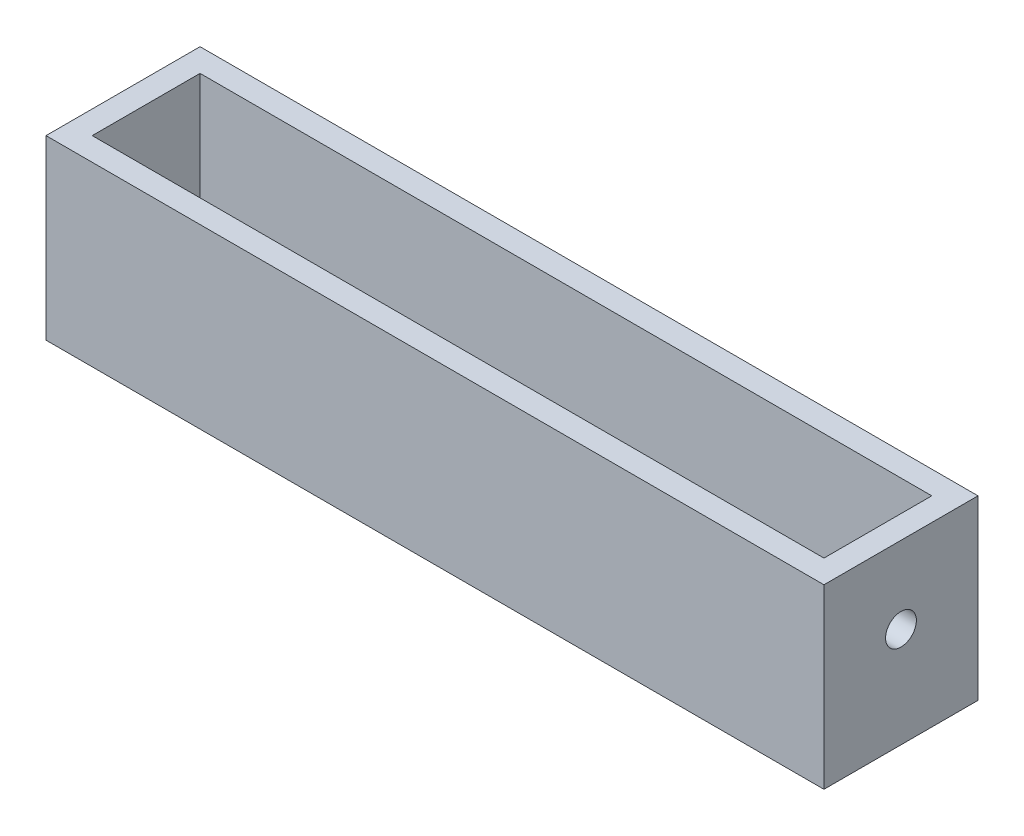
ISO-10303-21;
HEADER;
FILE_DESCRIPTION(('STEP AP214'),'2;1');
FILE_NAME('part.step','',(''),(''),'','','');
FILE_SCHEMA(('AUTOMOTIVE_DESIGN { 1 0 10303 214 1 1 1 1 }'));
ENDSEC;
DATA;
#1=APPLICATION_CONTEXT('core data for automotive mechanical design processes');
#2=APPLICATION_PROTOCOL_DEFINITION('international standard','automotive_design',2000,#1);
#3=PRODUCT_CONTEXT('',#1,'mechanical');
#4=PRODUCT('Part','Part','',(#3));
#5=PRODUCT_RELATED_PRODUCT_CATEGORY('part','',(#4));
#6=PRODUCT_DEFINITION_FORMATION('','',#4);
#7=PRODUCT_DEFINITION_CONTEXT('part definition',#1,'design');
#8=PRODUCT_DEFINITION('design','',#6,#7);
#9=PRODUCT_DEFINITION_SHAPE('','',#8);
#10=(LENGTH_UNIT() NAMED_UNIT(*) SI_UNIT(.MILLI.,.METRE.));
#11=(NAMED_UNIT(*) PLANE_ANGLE_UNIT() SI_UNIT($,.RADIAN.));
#12=(NAMED_UNIT(*) SI_UNIT($,.STERADIAN.) SOLID_ANGLE_UNIT());
#13=UNCERTAINTY_MEASURE_WITH_UNIT(LENGTH_MEASURE(1.E-05),#10,'distance_accuracy_value','');
#14=(GEOMETRIC_REPRESENTATION_CONTEXT(3) GLOBAL_UNCERTAINTY_ASSIGNED_CONTEXT((#13)) GLOBAL_UNIT_ASSIGNED_CONTEXT((#10,
#11,#12)) REPRESENTATION_CONTEXT('',''));
#15=CARTESIAN_POINT('',(0.,0.,0.));
#16=DIRECTION('',(0.,0.,1.));
#17=DIRECTION('',(1.,0.,0.));
#18=AXIS2_PLACEMENT_3D('',#15,#16,#17);
#19=CARTESIAN_POINT('',(0.,3.,0.));
#20=DIRECTION('',(0.,1.,0.));
#21=DIRECTION('',(0.,0.,1.));
#22=AXIS2_PLACEMENT_3D('',#19,#20,#21);
#23=PLANE('',#22);
#24=CARTESIAN_POINT('',(37.5,3.,0.));
#25=DIRECTION('',(0.,1.,0.));
#26=DIRECTION('',(0.,0.,1.));
#27=AXIS2_PLACEMENT_3D('',#24,#25,#26);
#28=CIRCLE('',#27,4.);
#29=CARTESIAN_POINT('',(37.5,3.,4.));
#30=VERTEX_POINT('',#29);
#31=EDGE_CURVE('E156',#30,#30,#28,.T.);
#32=ORIENTED_EDGE('',*,*,#31,.F.);
#33=EDGE_LOOP('',(#32));
#34=FACE_BOUND('',#33,.T.);
#35=CARTESIAN_POINT('',(-37.5,3.,0.));
#36=DIRECTION('',(0.,1.,0.));
#37=DIRECTION('',(0.,0.,1.));
#38=AXIS2_PLACEMENT_3D('',#35,#36,#37);
#39=CIRCLE('',#38,4.);
#40=CARTESIAN_POINT('',(-37.5,3.,4.));
#41=VERTEX_POINT('',#40);
#42=EDGE_CURVE('E159',#41,#41,#39,.T.);
#43=ORIENTED_EDGE('',*,*,#42,.F.);
#44=EDGE_LOOP('',(#43));
#45=FACE_BOUND('',#44,.T.);
#46=DIRECTION('',(0.,0.,-1.));
#47=VECTOR('',#46,1.);
#48=CARTESIAN_POINT('',(47.5,3.,-10.));
#49=LINE('',#48,#47);
#50=CARTESIAN_POINT('',(47.5,3.,7.));
#51=VERTEX_POINT('',#50);
#52=CARTESIAN_POINT('',(47.5,3.,-7.));
#53=VERTEX_POINT('',#52);
#54=EDGE_CURVE('E129',#51,#53,#49,.T.);
#55=ORIENTED_EDGE('',*,*,#54,.T.);
#56=DIRECTION('',(-1.,0.,0.));
#57=VECTOR('',#56,1.);
#58=CARTESIAN_POINT('',(47.5,3.,-7.));
#59=LINE('',#58,#57);
#60=CARTESIAN_POINT('',(-47.5,3.,-7.));
#61=VERTEX_POINT('',#60);
#62=EDGE_CURVE('E110',#53,#61,#59,.T.);
#63=ORIENTED_EDGE('',*,*,#62,.T.);
#64=DIRECTION('',(0.,0.,-1.));
#65=VECTOR('',#64,1.);
#66=CARTESIAN_POINT('',(-47.5,3.,0.));
#67=LINE('',#66,#65);
#68=CARTESIAN_POINT('',(-47.5,3.,7.));
#69=VERTEX_POINT('',#68);
#70=EDGE_CURVE('E145',#69,#61,#67,.T.);
#71=ORIENTED_EDGE('',*,*,#70,.F.);
#72=DIRECTION('',(1.,0.,0.));
#73=VECTOR('',#72,1.);
#74=CARTESIAN_POINT('',(47.5,3.,7.));
#75=LINE('',#74,#73);
#76=EDGE_CURVE('E238',#69,#51,#75,.T.);
#77=ORIENTED_EDGE('',*,*,#76,.T.);
#78=EDGE_LOOP('',(#55,#63,#71,#77));
#79=FACE_BOUND('',#78,.T.);
#80=ADVANCED_FACE('F38',(#34,#45,#79),#23,.T.);
#81=CARTESIAN_POINT('',(-47.5,0.,0.));
#82=DIRECTION('',(-1.,0.,0.));
#83=DIRECTION('',(0.,0.,1.));
#84=AXIS2_PLACEMENT_3D('',#81,#82,#83);
#85=PLANE('',#84);
#86=CARTESIAN_POINT('',(-47.5,13.,0.));
#87=DIRECTION('',(-1.,0.,0.));
#88=DIRECTION('',(0.,0.,1.));
#89=AXIS2_PLACEMENT_3D('',#86,#87,#88);
#90=CIRCLE('',#89,2.);
#91=CARTESIAN_POINT('',(-47.5,13.,2.));
#92=VERTEX_POINT('',#91);
#93=EDGE_CURVE('E141',#92,#92,#90,.T.);
#94=ORIENTED_EDGE('',*,*,#93,.T.);
#95=EDGE_LOOP('',(#94));
#96=FACE_BOUND('',#95,.T.);
#97=DIRECTION('',(0.,1.,0.));
#98=VECTOR('',#97,1.);
#99=CARTESIAN_POINT('',(-47.5,3.,-7.));
#100=LINE('',#99,#98);
#101=CARTESIAN_POINT('',(-47.5,23.,-7.));
#102=VERTEX_POINT('',#101);
#103=EDGE_CURVE('E242',#61,#102,#100,.T.);
#104=ORIENTED_EDGE('',*,*,#103,.T.);
#105=DIRECTION('',(0.,0.,1.));
#106=VECTOR('',#105,1.);
#107=CARTESIAN_POINT('',(-47.5,23.,0.));
#108=LINE('',#107,#106);
#109=CARTESIAN_POINT('',(-47.5,23.,7.));
#110=VERTEX_POINT('',#109);
#111=EDGE_CURVE('E123',#102,#110,#108,.T.);
#112=ORIENTED_EDGE('',*,*,#111,.T.);
#113=DIRECTION('',(0.,-1.,0.));
#114=VECTOR('',#113,1.);
#115=CARTESIAN_POINT('',(-47.5,3.,7.));
#116=LINE('',#115,#114);
#117=EDGE_CURVE('E250',#110,#69,#116,.T.);
#118=ORIENTED_EDGE('',*,*,#117,.T.);
#119=ORIENTED_EDGE('',*,*,#70,.T.);
#120=EDGE_LOOP('',(#104,#112,#118,#119));
#121=FACE_BOUND('',#120,.T.);
#122=ADVANCED_FACE('F199',(#96,#121),#85,.F.);
#123=CARTESIAN_POINT('',(47.5,0.,0.));
#124=DIRECTION('',(-1.,0.,0.));
#125=DIRECTION('',(0.,0.,1.));
#126=AXIS2_PLACEMENT_3D('',#123,#124,#125);
#127=PLANE('',#126);
#128=CARTESIAN_POINT('',(47.5,13.,0.));
#129=DIRECTION('',(1.,0.,0.));
#130=DIRECTION('',(0.,0.,-1.));
#131=AXIS2_PLACEMENT_3D('',#128,#129,#130);
#132=CIRCLE('',#131,2.);
#133=CARTESIAN_POINT('',(47.5,13.,-2.));
#134=VERTEX_POINT('',#133);
#135=EDGE_CURVE('E140',#134,#134,#132,.T.);
#136=ORIENTED_EDGE('',*,*,#135,.T.);
#137=EDGE_LOOP('',(#136));
#138=FACE_BOUND('',#137,.T.);
#139=DIRECTION('',(0.,0.,1.));
#140=VECTOR('',#139,1.);
#141=CARTESIAN_POINT('',(47.5,23.,10.));
#142=LINE('',#141,#140);
#143=CARTESIAN_POINT('',(47.5,23.,-7.));
#144=VERTEX_POINT('',#143);
#145=CARTESIAN_POINT('',(47.5,23.,7.));
#146=VERTEX_POINT('',#145);
#147=EDGE_CURVE('E121',#144,#146,#142,.T.);
#148=ORIENTED_EDGE('',*,*,#147,.F.);
#149=DIRECTION('',(0.,-1.,0.));
#150=VECTOR('',#149,1.);
#151=CARTESIAN_POINT('',(47.5,23.,-7.));
#152=LINE('',#151,#150);
#153=EDGE_CURVE('E104',#144,#53,#152,.T.);
#154=ORIENTED_EDGE('',*,*,#153,.T.);
#155=ORIENTED_EDGE('',*,*,#54,.F.);
#156=DIRECTION('',(0.,1.,0.));
#157=VECTOR('',#156,1.);
#158=CARTESIAN_POINT('',(47.5,23.,7.));
#159=LINE('',#158,#157);
#160=EDGE_CURVE('E127',#51,#146,#159,.T.);
#161=ORIENTED_EDGE('',*,*,#160,.T.);
#162=EDGE_LOOP('',(#148,#154,#155,#161));
#163=FACE_BOUND('',#162,.T.);
#164=ADVANCED_FACE('F126',(#138,#163),#127,.T.);
#165=CARTESIAN_POINT('',(0.,3.,10.));
#166=DIRECTION('',(0.,0.,-1.));
#167=DIRECTION('',(-1.,0.,0.));
#168=AXIS2_PLACEMENT_3D('',#165,#166,#167);
#169=PLANE('',#168);
#170=DIRECTION('',(1.,0.,0.));
#171=VECTOR('',#170,1.);
#172=CARTESIAN_POINT('',(0.,0.,10.));
#173=LINE('',#172,#171);
#174=CARTESIAN_POINT('',(-50.5,0.,10.));
#175=VERTEX_POINT('',#174);
#176=CARTESIAN_POINT('',(50.5,0.,10.));
#177=VERTEX_POINT('',#176);
#178=EDGE_CURVE('E168',#175,#177,#173,.T.);
#179=ORIENTED_EDGE('',*,*,#178,.T.);
#180=DIRECTION('',(0.,-1.,0.));
#181=VECTOR('',#180,1.);
#182=CARTESIAN_POINT('',(50.5,3.,10.));
#183=LINE('',#182,#181);
#184=CARTESIAN_POINT('',(50.5,23.,10.));
#185=VERTEX_POINT('',#184);
#186=EDGE_CURVE('E11',#185,#177,#183,.T.);
#187=ORIENTED_EDGE('',*,*,#186,.F.);
#188=DIRECTION('',(-1.,0.,0.));
#189=VECTOR('',#188,1.);
#190=CARTESIAN_POINT('',(-47.5,23.,10.));
#191=LINE('',#190,#189);
#192=CARTESIAN_POINT('',(-50.5,23.,10.));
#193=VERTEX_POINT('',#192);
#194=EDGE_CURVE('E147',#185,#193,#191,.T.);
#195=ORIENTED_EDGE('',*,*,#194,.T.);
#196=DIRECTION('',(0.,-1.,0.));
#197=VECTOR('',#196,1.);
#198=CARTESIAN_POINT('',(-50.5,3.,10.));
#199=LINE('',#198,#197);
#200=EDGE_CURVE('E53',#193,#175,#199,.T.);
#201=ORIENTED_EDGE('',*,*,#200,.T.);
#202=EDGE_LOOP('',(#179,#187,#195,#201));
#203=FACE_BOUND('',#202,.T.);
#204=ADVANCED_FACE('F191',(#203),#169,.F.);
#205=CARTESIAN_POINT('',(50.5,3.,0.));
#206=DIRECTION('',(-1.,0.,0.));
#207=DIRECTION('',(0.,0.,1.));
#208=AXIS2_PLACEMENT_3D('',#205,#206,#207);
#209=PLANE('',#208);
#210=DIRECTION('',(0.,0.,-1.));
#211=VECTOR('',#210,1.);
#212=CARTESIAN_POINT('',(50.5,0.,0.));
#213=LINE('',#212,#211);
#214=CARTESIAN_POINT('',(50.5,0.,-10.));
#215=VERTEX_POINT('',#214);
#216=EDGE_CURVE('E170',#177,#215,#213,.T.);
#217=ORIENTED_EDGE('',*,*,#216,.T.);
#218=DIRECTION('',(0.,-1.,0.));
#219=VECTOR('',#218,1.);
#220=CARTESIAN_POINT('',(50.5,3.,-10.));
#221=LINE('',#220,#219);
#222=CARTESIAN_POINT('',(50.5,23.,-10.));
#223=VERTEX_POINT('',#222);
#224=EDGE_CURVE('E46',#223,#215,#221,.T.);
#225=ORIENTED_EDGE('',*,*,#224,.F.);
#226=DIRECTION('',(0.,0.,1.));
#227=VECTOR('',#226,1.);
#228=CARTESIAN_POINT('',(50.5,23.,10.));
#229=LINE('',#228,#227);
#230=EDGE_CURVE('E134',#223,#185,#229,.T.);
#231=ORIENTED_EDGE('',*,*,#230,.T.);
#232=ORIENTED_EDGE('',*,*,#186,.T.);
#233=EDGE_LOOP('',(#217,#225,#231,#232));
#234=FACE_BOUND('',#233,.T.);
#235=CARTESIAN_POINT('',(50.5,13.,0.));
#236=DIRECTION('',(1.,0.,0.));
#237=DIRECTION('',(0.,0.,-1.));
#238=AXIS2_PLACEMENT_3D('',#235,#236,#237);
#239=CIRCLE('',#238,2.);
#240=CARTESIAN_POINT('',(50.5,13.,-2.));
#241=VERTEX_POINT('',#240);
#242=EDGE_CURVE('E252',#241,#241,#239,.T.);
#243=ORIENTED_EDGE('',*,*,#242,.F.);
#244=EDGE_LOOP('',(#243));
#245=FACE_BOUND('',#244,.T.);
#246=ADVANCED_FACE('F184',(#234,#245),#209,.F.);
#247=CARTESIAN_POINT('',(0.,3.,-10.));
#248=DIRECTION('',(0.,0.,-1.));
#249=DIRECTION('',(-1.,0.,0.));
#250=AXIS2_PLACEMENT_3D('',#247,#248,#249);
#251=PLANE('',#250);
#252=DIRECTION('',(-1.,0.,0.));
#253=VECTOR('',#252,1.);
#254=CARTESIAN_POINT('',(-47.5,23.,-10.));
#255=LINE('',#254,#253);
#256=CARTESIAN_POINT('',(-50.5,23.,-10.));
#257=VERTEX_POINT('',#256);
#258=EDGE_CURVE('E151',#223,#257,#255,.T.);
#259=ORIENTED_EDGE('',*,*,#258,.F.);
#260=ORIENTED_EDGE('',*,*,#224,.T.);
#261=DIRECTION('',(1.,0.,0.));
#262=VECTOR('',#261,1.);
#263=CARTESIAN_POINT('',(0.,0.,-10.));
#264=LINE('',#263,#262);
#265=CARTESIAN_POINT('',(-50.5,0.,-10.));
#266=VERTEX_POINT('',#265);
#267=EDGE_CURVE('E173',#266,#215,#264,.T.);
#268=ORIENTED_EDGE('',*,*,#267,.F.);
#269=DIRECTION('',(0.,-1.,0.));
#270=VECTOR('',#269,1.);
#271=CARTESIAN_POINT('',(-50.5,3.,-10.));
#272=LINE('',#271,#270);
#273=EDGE_CURVE('E61',#257,#266,#272,.T.);
#274=ORIENTED_EDGE('',*,*,#273,.F.);
#275=EDGE_LOOP('',(#259,#260,#268,#274));
#276=FACE_BOUND('',#275,.T.);
#277=ADVANCED_FACE('F181',(#276),#251,.T.);
#278=CARTESIAN_POINT('',(-37.5,3.,0.));
#279=DIRECTION('',(0.,-1.,0.));
#280=DIRECTION('',(0.,0.,-1.));
#281=AXIS2_PLACEMENT_3D('',#278,#279,#280);
#282=CYLINDRICAL_SURFACE('',#281,4.);
#283=ORIENTED_EDGE('',*,*,#42,.T.);
#284=EDGE_LOOP('',(#283));
#285=FACE_BOUND('',#284,.T.);
#286=CARTESIAN_POINT('',(-37.5,0.,0.));
#287=DIRECTION('',(0.,1.,0.));
#288=DIRECTION('',(0.,0.,1.));
#289=AXIS2_PLACEMENT_3D('',#286,#287,#288);
#290=CIRCLE('',#289,4.);
#291=CARTESIAN_POINT('',(-37.5,0.,4.));
#292=VERTEX_POINT('',#291);
#293=EDGE_CURVE('E165',#292,#292,#290,.T.);
#294=ORIENTED_EDGE('',*,*,#293,.F.);
#295=EDGE_LOOP('',(#294));
#296=FACE_BOUND('',#295,.T.);
#297=ADVANCED_FACE('F222',(#285,#296),#282,.F.);
#298=CARTESIAN_POINT('',(37.5,3.,0.));
#299=DIRECTION('',(0.,-1.,0.));
#300=DIRECTION('',(0.,0.,-1.));
#301=AXIS2_PLACEMENT_3D('',#298,#299,#300);
#302=CYLINDRICAL_SURFACE('',#301,4.);
#303=ORIENTED_EDGE('',*,*,#31,.T.);
#304=EDGE_LOOP('',(#303));
#305=FACE_BOUND('',#304,.T.);
#306=CARTESIAN_POINT('',(37.5,0.,0.));
#307=DIRECTION('',(0.,1.,0.));
#308=DIRECTION('',(0.,0.,1.));
#309=AXIS2_PLACEMENT_3D('',#306,#307,#308);
#310=CIRCLE('',#309,4.);
#311=CARTESIAN_POINT('',(37.5,0.,4.));
#312=VERTEX_POINT('',#311);
#313=EDGE_CURVE('E154',#312,#312,#310,.T.);
#314=ORIENTED_EDGE('',*,*,#313,.F.);
#315=EDGE_LOOP('',(#314));
#316=FACE_BOUND('',#315,.T.);
#317=ADVANCED_FACE('F40',(#305,#316),#302,.F.);
#318=CARTESIAN_POINT('',(-50.5,3.,0.));
#319=DIRECTION('',(-1.,0.,0.));
#320=DIRECTION('',(0.,0.,1.));
#321=AXIS2_PLACEMENT_3D('',#318,#319,#320);
#322=PLANE('',#321);
#323=DIRECTION('',(0.,0.,-1.));
#324=VECTOR('',#323,1.);
#325=CARTESIAN_POINT('',(-50.5,0.,0.));
#326=LINE('',#325,#324);
#327=EDGE_CURVE('E160',#175,#266,#326,.T.);
#328=ORIENTED_EDGE('',*,*,#327,.F.);
#329=ORIENTED_EDGE('',*,*,#200,.F.);
#330=DIRECTION('',(0.,0.,1.));
#331=VECTOR('',#330,1.);
#332=CARTESIAN_POINT('',(-50.5,23.,0.));
#333=LINE('',#332,#331);
#334=EDGE_CURVE('E132',#257,#193,#333,.T.);
#335=ORIENTED_EDGE('',*,*,#334,.F.);
#336=ORIENTED_EDGE('',*,*,#273,.T.);
#337=EDGE_LOOP('',(#328,#329,#335,#336));
#338=FACE_BOUND('',#337,.T.);
#339=CARTESIAN_POINT('',(-50.5,13.,0.));
#340=DIRECTION('',(-1.,0.,0.));
#341=DIRECTION('',(0.,0.,1.));
#342=AXIS2_PLACEMENT_3D('',#339,#340,#341);
#343=CIRCLE('',#342,2.);
#344=CARTESIAN_POINT('',(-50.5,13.,2.));
#345=VERTEX_POINT('',#344);
#346=EDGE_CURVE('E128',#345,#345,#343,.T.);
#347=ORIENTED_EDGE('',*,*,#346,.F.);
#348=EDGE_LOOP('',(#347));
#349=FACE_BOUND('',#348,.T.);
#350=ADVANCED_FACE('F189',(#338,#349),#322,.T.);
#351=CARTESIAN_POINT('',(0.,0.,0.));
#352=DIRECTION('',(0.,1.,0.));
#353=DIRECTION('',(0.,0.,1.));
#354=AXIS2_PLACEMENT_3D('',#351,#352,#353);
#355=PLANE('',#354);
#356=ORIENTED_EDGE('',*,*,#313,.T.);
#357=EDGE_LOOP('',(#356));
#358=FACE_BOUND('',#357,.T.);
#359=ORIENTED_EDGE('',*,*,#293,.T.);
#360=EDGE_LOOP('',(#359));
#361=FACE_BOUND('',#360,.T.);
#362=ORIENTED_EDGE('',*,*,#178,.F.);
#363=ORIENTED_EDGE('',*,*,#327,.T.);
#364=ORIENTED_EDGE('',*,*,#267,.T.);
#365=ORIENTED_EDGE('',*,*,#216,.F.);
#366=EDGE_LOOP('',(#362,#363,#364,#365));
#367=FACE_BOUND('',#366,.T.);
#368=ADVANCED_FACE('F188',(#358,#361,#367),#355,.F.);
#369=CARTESIAN_POINT('',(-47.5,13.,0.));
#370=DIRECTION('',(-1.,0.,0.));
#371=DIRECTION('',(0.,0.,1.));
#372=AXIS2_PLACEMENT_3D('',#369,#370,#371);
#373=CYLINDRICAL_SURFACE('',#372,2.);
#374=ORIENTED_EDGE('',*,*,#93,.F.);
#375=EDGE_LOOP('',(#374));
#376=FACE_BOUND('',#375,.T.);
#377=ORIENTED_EDGE('',*,*,#346,.T.);
#378=EDGE_LOOP('',(#377));
#379=FACE_BOUND('',#378,.T.);
#380=ADVANCED_FACE('F214',(#376,#379),#373,.F.);
#381=CARTESIAN_POINT('',(-47.5,23.,0.));
#382=DIRECTION('',(0.,-1.,0.));
#383=DIRECTION('',(0.,0.,-1.));
#384=AXIS2_PLACEMENT_3D('',#381,#382,#383);
#385=PLANE('',#384);
#386=ORIENTED_EDGE('',*,*,#111,.F.);
#387=DIRECTION('',(1.,0.,0.));
#388=VECTOR('',#387,1.);
#389=CARTESIAN_POINT('',(-47.5,23.,-7.));
#390=LINE('',#389,#388);
#391=EDGE_CURVE('E107',#102,#144,#390,.T.);
#392=ORIENTED_EDGE('',*,*,#391,.T.);
#393=ORIENTED_EDGE('',*,*,#147,.T.);
#394=DIRECTION('',(-1.,0.,0.));
#395=VECTOR('',#394,1.);
#396=CARTESIAN_POINT('',(-47.5,23.,7.));
#397=LINE('',#396,#395);
#398=EDGE_CURVE('E244',#146,#110,#397,.T.);
#399=ORIENTED_EDGE('',*,*,#398,.T.);
#400=EDGE_LOOP('',(#386,#392,#393,#399));
#401=FACE_BOUND('',#400,.T.);
#402=ORIENTED_EDGE('',*,*,#334,.T.);
#403=ORIENTED_EDGE('',*,*,#194,.F.);
#404=ORIENTED_EDGE('',*,*,#230,.F.);
#405=ORIENTED_EDGE('',*,*,#258,.T.);
#406=EDGE_LOOP('',(#402,#403,#404,#405));
#407=FACE_BOUND('',#406,.T.);
#408=ADVANCED_FACE('F118',(#401,#407),#385,.F.);
#409=CARTESIAN_POINT('',(47.5,13.,0.));
#410=DIRECTION('',(1.,0.,0.));
#411=DIRECTION('',(0.,0.,-1.));
#412=AXIS2_PLACEMENT_3D('',#409,#410,#411);
#413=CYLINDRICAL_SURFACE('',#412,2.);
#414=ORIENTED_EDGE('',*,*,#135,.F.);
#415=EDGE_LOOP('',(#414));
#416=FACE_BOUND('',#415,.T.);
#417=ORIENTED_EDGE('',*,*,#242,.T.);
#418=EDGE_LOOP('',(#417));
#419=FACE_BOUND('',#418,.T.);
#420=ADVANCED_FACE('F257',(#416,#419),#413,.F.);
#421=CARTESIAN_POINT('',(0.,0.,7.));
#422=DIRECTION('',(0.,0.,-1.));
#423=DIRECTION('',(-1.,0.,0.));
#424=AXIS2_PLACEMENT_3D('',#421,#422,#423);
#425=PLANE('',#424);
#426=ORIENTED_EDGE('',*,*,#76,.F.);
#427=ORIENTED_EDGE('',*,*,#117,.F.);
#428=ORIENTED_EDGE('',*,*,#398,.F.);
#429=ORIENTED_EDGE('',*,*,#160,.F.);
#430=EDGE_LOOP('',(#426,#427,#428,#429));
#431=FACE_BOUND('',#430,.T.);
#432=ADVANCED_FACE('F259',(#431),#425,.T.);
#433=CARTESIAN_POINT('',(0.,0.,-7.));
#434=DIRECTION('',(0.,0.,-1.));
#435=DIRECTION('',(-1.,0.,0.));
#436=AXIS2_PLACEMENT_3D('',#433,#434,#435);
#437=PLANE('',#436);
#438=ORIENTED_EDGE('',*,*,#391,.F.);
#439=ORIENTED_EDGE('',*,*,#103,.F.);
#440=ORIENTED_EDGE('',*,*,#62,.F.);
#441=ORIENTED_EDGE('',*,*,#153,.F.);
#442=EDGE_LOOP('',(#438,#439,#440,#441));
#443=FACE_BOUND('',#442,.T.);
#444=ADVANCED_FACE('F106',(#443),#437,.F.);
#445=CLOSED_SHELL('',(#80,#122,#164,#204,#246,#277,#297,#317,#350,#368,#380,#408,#420,#432,#444));
#446=MANIFOLD_SOLID_BREP('B2',#445);
#447=ADVANCED_BREP_SHAPE_REPRESENTATION('',(#18,#446),#14);
#448=SHAPE_DEFINITION_REPRESENTATION(#9,#447);
ENDSEC;
END-ISO-10303-21;
